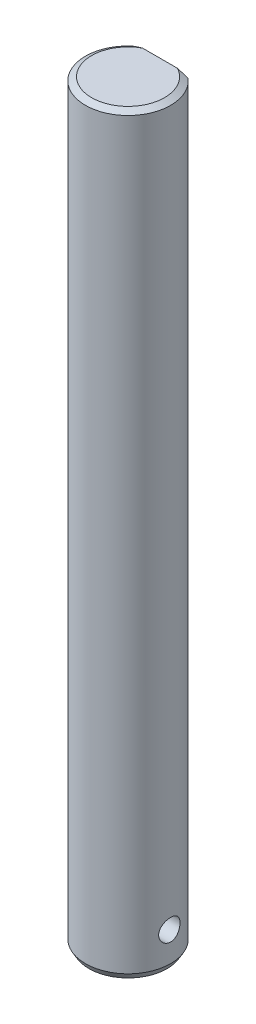
ISO-10303-21;
HEADER;
FILE_DESCRIPTION(('STEP AP214'),'2;1');
FILE_NAME('part.step','',(''),(''),'','','');
FILE_SCHEMA(('AUTOMOTIVE_DESIGN { 1 0 10303 214 1 1 1 1 }'));
ENDSEC;
DATA;
#1=APPLICATION_CONTEXT('core data for automotive mechanical design processes');
#2=APPLICATION_PROTOCOL_DEFINITION('international standard','automotive_design',2000,#1);
#3=PRODUCT_CONTEXT('',#1,'mechanical');
#4=PRODUCT('Part','Part','',(#3));
#5=PRODUCT_RELATED_PRODUCT_CATEGORY('part','',(#4));
#6=PRODUCT_DEFINITION_FORMATION('','',#4);
#7=PRODUCT_DEFINITION_CONTEXT('part definition',#1,'design');
#8=PRODUCT_DEFINITION('design','',#6,#7);
#9=PRODUCT_DEFINITION_SHAPE('','',#8);
#10=(LENGTH_UNIT() NAMED_UNIT(*) SI_UNIT(.MILLI.,.METRE.));
#11=(NAMED_UNIT(*) PLANE_ANGLE_UNIT() SI_UNIT($,.RADIAN.));
#12=(NAMED_UNIT(*) SI_UNIT($,.STERADIAN.) SOLID_ANGLE_UNIT());
#13=UNCERTAINTY_MEASURE_WITH_UNIT(LENGTH_MEASURE(1.E-05),#10,'distance_accuracy_value','');
#14=(GEOMETRIC_REPRESENTATION_CONTEXT(3) GLOBAL_UNCERTAINTY_ASSIGNED_CONTEXT((#13)) GLOBAL_UNIT_ASSIGNED_CONTEXT((#10,
#11,#12)) REPRESENTATION_CONTEXT('',''));
#15=CARTESIAN_POINT('',(0.,0.,0.));
#16=DIRECTION('',(0.,0.,1.));
#17=DIRECTION('',(1.,0.,0.));
#18=AXIS2_PLACEMENT_3D('',#15,#16,#17);
#19=CARTESIAN_POINT('',(0.,106.,0.));
#20=DIRECTION('',(0.,-1.,0.));
#21=DIRECTION('',(0.,0.,-1.));
#22=AXIS2_PLACEMENT_3D('',#19,#20,#21);
#23=CYLINDRICAL_SURFACE('',#22,6.);
#24=CARTESIAN_POINT('',(0.,0.866025403784401,0.));
#25=DIRECTION('',(0.,1.,0.));
#26=DIRECTION('',(0.,0.,1.));
#27=AXIS2_PLACEMENT_3D('',#24,#25,#26);
#28=CIRCLE('',#27,6.);
#29=CARTESIAN_POINT('',(0.,0.866025403784401,6.));
#30=VERTEX_POINT('',#29);
#31=EDGE_CURVE('E145',#30,#30,#28,.T.);
#32=ORIENTED_EDGE('',*,*,#31,.T.);
#33=EDGE_LOOP('',(#32));
#34=FACE_BOUND('',#33,.T.);
#35=CARTESIAN_POINT('',(-5.80947501931113,5.,-1.5));
#36=CARTESIAN_POINT('',(-5.80947660051185,5.08283045055477,-1.49999764715507));
#37=CARTESIAN_POINT('',(-5.81126583608348,5.1656869392068,-1.49311574729838));
#38=CARTESIAN_POINT('',(-5.81821117195949,5.32902054690442,-1.46581387527848));
#39=CARTESIAN_POINT('',(-5.82336923173088,5.409496252681,-1.44538602404532));
#40=CARTESIAN_POINT('',(-5.8364323475758,5.56568212291222,-1.39169471977917));
#41=CARTESIAN_POINT('',(-5.84433385614245,5.6413982932314,-1.35844783671268));
#42=CARTESIAN_POINT('',(-5.86198915217285,5.78618651152395,-1.28011268475685));
#43=CARTESIAN_POINT('',(-5.87174301827101,5.85525827724814,-1.23502391313642));
#44=CARTESIAN_POINT('',(-5.89224429813367,5.98631698715732,-1.13322505638713));
#45=CARTESIAN_POINT('',(-5.90300758573818,6.04813616021003,-1.07630213262243));
#46=CARTESIAN_POINT('',(-5.92417725309178,6.16145683661621,-0.952909238460399));
#47=CARTESIAN_POINT('',(-5.93458359939834,6.21295737537305,-0.886438376508184));
#48=CARTESIAN_POINT('',(-5.95404249312349,6.30486528057877,-0.744687120647372));
#49=CARTESIAN_POINT('',(-5.96307412440355,6.34510783289688,-0.669296745717072));
#50=CARTESIAN_POINT('',(-5.97858487155591,6.41228578649185,-0.512557910575657));
#51=CARTESIAN_POINT('',(-5.98506436400607,6.43922315114931,-0.431210331475164));
#52=CARTESIAN_POINT('',(-5.99462855308908,6.47848870074715,-0.266615255252496));
#53=CARTESIAN_POINT('',(-5.99777936306589,6.49110178659595,-0.183439631729385));
#54=CARTESIAN_POINT('',(-6.00056156464379,6.50225502756533,-0.0160972915576611));
#55=CARTESIAN_POINT('',(-6.00019347658022,6.50079726332576,0.0680692767228416));
#56=CARTESIAN_POINT('',(-5.99602856972121,6.48405508984991,0.233028370758581));
#57=CARTESIAN_POINT('',(-5.99230801404524,6.46907820496769,0.313854323401601));
#58=CARTESIAN_POINT('',(-5.98194501914912,6.4262172379709,0.47180737112053));
#59=CARTESIAN_POINT('',(-5.97530242439065,6.39833246877355,0.548934269055657));
#60=CARTESIAN_POINT('',(-5.95972505820537,6.33019845758776,0.69811005525271));
#61=CARTESIAN_POINT('',(-5.95077011817032,6.28983977320295,0.770106764649757));
#62=CARTESIAN_POINT('',(-5.9315394228579,6.19798659253025,0.906413433510733));
#63=CARTESIAN_POINT('',(-5.92126343791494,6.14649015886363,0.970722052628258));
#64=CARTESIAN_POINT('',(-5.90018228261712,6.03217475481057,1.09166105262743));
#65=CARTESIAN_POINT('',(-5.88937031715551,5.96908706459134,1.1480365186128));
#66=CARTESIAN_POINT('',(-5.86869026110024,5.83424001587585,1.24946456394453));
#67=CARTESIAN_POINT('',(-5.85882221463582,5.7624802523054,1.29451661406902));
#68=CARTESIAN_POINT('',(-5.84112298098989,5.61182597951062,1.3721821935339));
#69=CARTESIAN_POINT('',(-5.83330190235432,5.53289856181208,1.40473435045574));
#70=CARTESIAN_POINT('',(-5.82071184083974,5.37044871915413,1.45602843095451));
#71=CARTESIAN_POINT('',(-5.81594220486131,5.28692728161012,1.47477330982936));
#72=CARTESIAN_POINT('',(-5.81013213623485,5.12002429908613,1.49749778319911));
#73=CARTESIAN_POINT('',(-5.80899653456189,5.03669732400222,1.50185428435178));
#74=CARTESIAN_POINT('',(-5.81032406088624,4.8705068380531,1.49671019430933));
#75=CARTESIAN_POINT('',(-5.8127868576076,4.78764328522926,1.48721087870928));
#76=CARTESIAN_POINT('',(-5.82094249172736,4.62613144102718,1.4549552783626));
#77=CARTESIAN_POINT('',(-5.82658182140625,4.54743636405749,1.43241844096905));
#78=CARTESIAN_POINT('',(-5.84040430962577,4.39494112528899,1.37497084900237));
#79=CARTESIAN_POINT('',(-5.84858776949168,4.3211415445668,1.34005862862753));
#80=CARTESIAN_POINT('',(-5.86677682255958,4.17893523327959,1.25806240076193));
#81=CARTESIAN_POINT('',(-5.87681501163985,4.11066269597414,1.21075305230138));
#82=CARTESIAN_POINT('',(-5.8975024984303,3.98288698231919,1.10559043940168));
#83=CARTESIAN_POINT('',(-5.90815189637082,3.92338525000996,1.04773544220816));
#84=CARTESIAN_POINT('',(-5.92918441818964,3.81331337445743,0.921394081477089));
#85=CARTESIAN_POINT('',(-5.93955421237102,3.76300396247071,0.852677928797389));
#86=CARTESIAN_POINT('',(-5.95858329968241,3.67463847982925,0.707554024042013));
#87=CARTESIAN_POINT('',(-5.96724268202376,3.63658177003508,0.631146673436387));
#88=CARTESIAN_POINT('',(-5.98182069442989,3.57413237928324,0.473337302596636));
#89=CARTESIAN_POINT('',(-5.98775898013446,3.54964142937256,0.391976071541822));
#90=CARTESIAN_POINT('',(-5.99631176037473,3.51472379923495,0.226124640478212));
#91=CARTESIAN_POINT('',(-5.99892689636045,3.50429440475657,0.141635047561866));
#92=CARTESIAN_POINT('',(-6.00051254113217,3.4979486156367,-0.0256252896649892));
#93=CARTESIAN_POINT('',(-5.99957968320012,3.50164743635691,-0.108380740449049));
#94=CARTESIAN_POINT('',(-5.99438844686135,3.5225717409415,-0.272051244622109));
#95=CARTESIAN_POINT('',(-5.99013016735643,3.53979682251965,-0.35296635267133));
#96=CARTESIAN_POINT('',(-5.97878149280944,3.58707832965639,-0.510256553467224));
#97=CARTESIAN_POINT('',(-5.97170646753999,3.61706517997194,-0.586653741871528));
#98=CARTESIAN_POINT('',(-5.95546933370076,3.68895586852899,-0.733375579562202));
#99=CARTESIAN_POINT('',(-5.94630696206604,3.73086120900435,-0.803699461897577));
#100=CARTESIAN_POINT('',(-5.92660874521999,3.82657285099561,-0.938102892635849));
#101=CARTESIAN_POINT('',(-5.91604525418417,3.88064021436107,-1.00199248245088));
#102=CARTESIAN_POINT('',(-5.89485973579863,3.9986342779607,-1.11992253040688));
#103=CARTESIAN_POINT('',(-5.88423769428834,4.06256347414686,-1.17396048760228));
#104=CARTESIAN_POINT('',(-5.86391213790822,4.199902121302,-1.27164303971884));
#105=CARTESIAN_POINT('',(-5.85422945594827,4.27346618511894,-1.31507492916982));
#106=CARTESIAN_POINT('',(-5.83715933325924,4.42708323488405,-1.3888903449235));
#107=CARTESIAN_POINT('',(-5.82977022370054,4.50713144916011,-1.41928336463958));
#108=CARTESIAN_POINT('',(-5.81927863109675,4.65586551774007,-1.46163379284816));
#109=CARTESIAN_POINT('',(-5.8156299450082,4.72383974657579,-1.47598975589307));
#110=CARTESIAN_POINT('',(-5.81072757878358,4.86120330349995,-1.4951734388599));
#111=CARTESIAN_POINT('',(-5.80947369434945,4.93059251036759,-1.50000197155828));
#112=CARTESIAN_POINT('',(-5.80947501931113,5.,-1.5));
#113=B_SPLINE_CURVE_WITH_KNOTS('',3,(#35,#36,#37,#38,#39,#40,#41,#42,#43,#44,#45,#46,#47,#48,
#49,#50,#51,#52,#53,#54,#55,#56,#57,#58,#59,#60,#61,#62,#63,#64,#65,#66,#67,#68,#69,#70,#71,#72,
#73,#74,#75,#76,#77,#78,#79,#80,#81,#82,#83,#84,#85,#86,#87,#88,#89,#90,#91,#92,#93,#94,#95,#96,
#97,#98,#99,#100,#101,#102,#103,#104,#105,#106,#107,#108,#109,#110,#111,#112),.UNSPECIFIED.,.T.,
.F.,(4,2,2,2,2,2,2,2,2,2,2,2,2,2,2,2,2,2,2,2,2,2,2,2,2,2,2,2,2,2,2,2,2,2,2,2,2,2,4),(0.,
0.248236465041681,0.4966174448572,0.744678436299612,0.99274996053287,1.24574372515786,
1.4987611288792,1.75530897838752,2.01181895908255,2.26313250597208,2.51440889199612,
2.76010957613368,3.00582334034872,3.25375724552667,3.50173431281348,3.75642279943147,
4.01112318719881,4.26705859205041,4.52293920077728,4.7720614485703,5.02116076310281,
5.26618443005524,5.5112371285285,5.76109707515494,6.01099811331027,6.26715198579191,
6.52329249431732,6.77755243684158,7.03176329345423,7.27910067676474,7.52643070426189,
7.77242925935827,8.01845883442843,8.27038257949243,8.52237018939306,8.77905886370806,
9.03556032819972,9.24358696306398,9.45159585059713),.UNSPECIFIED.);
#114=CARTESIAN_POINT('',(-5.80947501931113,5.,-1.5));
#115=VERTEX_POINT('',#114);
#116=EDGE_CURVE('E93',#115,#115,#113,.T.);
#117=ORIENTED_EDGE('',*,*,#116,.T.);
#118=EDGE_LOOP('',(#117));
#119=FACE_BOUND('',#118,.T.);
#120=CARTESIAN_POINT('',(5.80947501931113,5.,-1.5));
#121=CARTESIAN_POINT('',(5.80947660051185,4.91716954944523,-1.49999764715507));
#122=CARTESIAN_POINT('',(5.81126583608348,4.8343130607932,-1.49311574729838));
#123=CARTESIAN_POINT('',(5.81821117195949,4.67097945309558,-1.46581387527848));
#124=CARTESIAN_POINT('',(5.82336923173088,4.590503747319,-1.44538602404532));
#125=CARTESIAN_POINT('',(5.8364323475758,4.43431787708778,-1.39169471977917));
#126=CARTESIAN_POINT('',(5.84433385614245,4.3586017067686,-1.35844783671268));
#127=CARTESIAN_POINT('',(5.86198915217285,4.21381348847605,-1.28011268475685));
#128=CARTESIAN_POINT('',(5.87174301827101,4.14474172275186,-1.23502391313642));
#129=CARTESIAN_POINT('',(5.89224429813367,4.01368301284268,-1.13322505638713));
#130=CARTESIAN_POINT('',(5.90300758573818,3.95186383978997,-1.07630213262243));
#131=CARTESIAN_POINT('',(5.92417725309178,3.83854316338379,-0.952909238460399));
#132=CARTESIAN_POINT('',(5.93458359939834,3.78704262462695,-0.886438376508185));
#133=CARTESIAN_POINT('',(5.95404249312349,3.69513471942123,-0.744687120647373));
#134=CARTESIAN_POINT('',(5.96307412440355,3.65489216710312,-0.669296745717072));
#135=CARTESIAN_POINT('',(5.97858487155591,3.58771421350815,-0.512557910575657));
#136=CARTESIAN_POINT('',(5.98506436400607,3.56077684885069,-0.431210331475164));
#137=CARTESIAN_POINT('',(5.99462855308908,3.52151129925285,-0.266615255252496));
#138=CARTESIAN_POINT('',(5.99777936306589,3.50889821340405,-0.183439631729385));
#139=CARTESIAN_POINT('',(6.00056156464379,3.49774497243467,-0.0160972915576611));
#140=CARTESIAN_POINT('',(6.00019347658022,3.49920273667424,0.0680692767228415));
#141=CARTESIAN_POINT('',(5.99602856972121,3.51594491015009,0.233028370758581));
#142=CARTESIAN_POINT('',(5.99230801404524,3.53092179503231,0.313854323401601));
#143=CARTESIAN_POINT('',(5.98194501914912,3.5737827620291,0.47180737112053));
#144=CARTESIAN_POINT('',(5.97530242439065,3.60166753122645,0.548934269055657));
#145=CARTESIAN_POINT('',(5.95972505820537,3.66980154241224,0.69811005525271));
#146=CARTESIAN_POINT('',(5.95077011817032,3.71016022679705,0.770106764649757));
#147=CARTESIAN_POINT('',(5.9315394228579,3.80201340746975,0.906413433510733));
#148=CARTESIAN_POINT('',(5.92126343791494,3.85350984113637,0.970722052628258));
#149=CARTESIAN_POINT('',(5.90018228261712,3.96782524518943,1.09166105262743));
#150=CARTESIAN_POINT('',(5.88937031715551,4.03091293540866,1.1480365186128));
#151=CARTESIAN_POINT('',(5.86869026110024,4.16575998412415,1.24946456394453));
#152=CARTESIAN_POINT('',(5.85882221463582,4.2375197476946,1.29451661406902));
#153=CARTESIAN_POINT('',(5.84112298098989,4.38817402048938,1.3721821935339));
#154=CARTESIAN_POINT('',(5.83330190235432,4.46710143818792,1.40473435045574));
#155=CARTESIAN_POINT('',(5.82071184083974,4.62955128084587,1.45602843095451));
#156=CARTESIAN_POINT('',(5.81594220486131,4.71307271838988,1.47477330982936));
#157=CARTESIAN_POINT('',(5.81013213623485,4.87997570091387,1.49749778319911));
#158=CARTESIAN_POINT('',(5.80899653456189,4.96330267599778,1.50185428435178));
#159=CARTESIAN_POINT('',(5.81032406088624,5.1294931619469,1.49671019430933));
#160=CARTESIAN_POINT('',(5.8127868576076,5.21235671477074,1.48721087870928));
#161=CARTESIAN_POINT('',(5.82094249172736,5.37386855897282,1.4549552783626));
#162=CARTESIAN_POINT('',(5.82658182140625,5.45256363594251,1.43241844096905));
#163=CARTESIAN_POINT('',(5.84040430962577,5.60505887471101,1.37497084900237));
#164=CARTESIAN_POINT('',(5.84858776949168,5.6788584554332,1.34005862862753));
#165=CARTESIAN_POINT('',(5.86677682255958,5.82106476672041,1.25806240076193));
#166=CARTESIAN_POINT('',(5.87681501163985,5.88933730402586,1.21075305230138));
#167=CARTESIAN_POINT('',(5.8975024984303,6.01711301768081,1.10559043940168));
#168=CARTESIAN_POINT('',(5.90815189637082,6.07661474999004,1.04773544220816));
#169=CARTESIAN_POINT('',(5.92918441818964,6.18668662554257,0.921394081477089));
#170=CARTESIAN_POINT('',(5.93955421237101,6.23699603752929,0.852677928797389));
#171=CARTESIAN_POINT('',(5.95858329968241,6.32536152017075,0.707554024042013));
#172=CARTESIAN_POINT('',(5.96724268202376,6.36341822996492,0.631146673436387));
#173=CARTESIAN_POINT('',(5.98182069442989,6.42586762071676,0.473337302596636));
#174=CARTESIAN_POINT('',(5.98775898013446,6.45035857062744,0.391976071541822));
#175=CARTESIAN_POINT('',(5.99631176037473,6.48527620076505,0.226124640478212));
#176=CARTESIAN_POINT('',(5.99892689636045,6.49570559524343,0.141635047561865));
#177=CARTESIAN_POINT('',(6.00051254113217,6.5020513843633,-0.0256252896649894));
#178=CARTESIAN_POINT('',(5.99957968320012,6.49835256364309,-0.10838074044905));
#179=CARTESIAN_POINT('',(5.99438844686135,6.4774282590585,-0.272051244622109));
#180=CARTESIAN_POINT('',(5.99013016735643,6.46020317748035,-0.35296635267133));
#181=CARTESIAN_POINT('',(5.97878149280944,6.41292167034361,-0.510256553467224));
#182=CARTESIAN_POINT('',(5.97170646753999,6.38293482002806,-0.586653741871528));
#183=CARTESIAN_POINT('',(5.95546933370076,6.31104413147101,-0.733375579562202));
#184=CARTESIAN_POINT('',(5.94630696206604,6.26913879099565,-0.803699461897577));
#185=CARTESIAN_POINT('',(5.92660874521999,6.17342714900439,-0.938102892635849));
#186=CARTESIAN_POINT('',(5.91604525418417,6.11935978563893,-1.00199248245088));
#187=CARTESIAN_POINT('',(5.89485973579863,6.0013657220393,-1.11992253040688));
#188=CARTESIAN_POINT('',(5.88423769428834,5.93743652585314,-1.17396048760228));
#189=CARTESIAN_POINT('',(5.86391213790822,5.800097878698,-1.27164303971884));
#190=CARTESIAN_POINT('',(5.85422945594827,5.72653381488106,-1.31507492916982));
#191=CARTESIAN_POINT('',(5.83715933325924,5.57291676511595,-1.3888903449235));
#192=CARTESIAN_POINT('',(5.82977022370054,5.49286855083989,-1.41928336463958));
#193=CARTESIAN_POINT('',(5.81927863109675,5.34413448225992,-1.46163379284816));
#194=CARTESIAN_POINT('',(5.8156299450082,5.27616025342421,-1.47598975589307));
#195=CARTESIAN_POINT('',(5.81072757878358,5.13879669650005,-1.4951734388599));
#196=CARTESIAN_POINT('',(5.80947369434945,5.06940748963241,-1.50000197155828));
#197=CARTESIAN_POINT('',(5.80947501931113,5.,-1.5));
#198=B_SPLINE_CURVE_WITH_KNOTS('',3,(#120,#121,#122,#123,#124,#125,#126,#127,#128,#129,#130,
#131,#132,#133,#134,#135,#136,#137,#138,#139,#140,#141,#142,#143,#144,#145,#146,#147,#148,#149,
#150,#151,#152,#153,#154,#155,#156,#157,#158,#159,#160,#161,#162,#163,#164,#165,#166,#167,#168,
#169,#170,#171,#172,#173,#174,#175,#176,#177,#178,#179,#180,#181,#182,#183,#184,#185,#186,#187,
#188,#189,#190,#191,#192,#193,#194,#195,#196,#197),.UNSPECIFIED.,.T.,.F.,(4,2,2,2,2,2,2,2,2,2,2,
2,2,2,2,2,2,2,2,2,2,2,2,2,2,2,2,2,2,2,2,2,2,2,2,2,2,2,4),(0.,0.248236465041681,0.4966174448572,
0.744678436299612,0.99274996053287,1.24574372515786,1.4987611288792,1.75530897838752,
2.01181895908255,2.26313250597208,2.51440889199612,2.76010957613368,3.00582334034872,
3.25375724552667,3.50173431281348,3.75642279943147,4.01112318719881,4.26705859205042,
4.52293920077729,4.7720614485703,5.02116076310281,5.26618443005524,5.5112371285285,
5.76109707515494,6.01099811331027,6.26715198579191,6.52329249431732,6.77755243684157,
7.03176329345423,7.27910067676474,7.52643070426189,7.77242925935826,8.01845883442843,
8.27038257949242,8.52237018939305,8.77905886370806,9.03556032819971,9.24358696306398,
9.45159585059712),.UNSPECIFIED.);
#199=CARTESIAN_POINT('',(5.80947501931113,5.,-1.5));
#200=VERTEX_POINT('',#199);
#201=EDGE_CURVE('E99',#200,#200,#198,.T.);
#202=ORIENTED_EDGE('',*,*,#201,.T.);
#203=EDGE_LOOP('',(#202));
#204=FACE_BOUND('',#203,.T.);
#205=DIRECTION('',(0.,-1.,0.));
#206=VECTOR('',#205,1.);
#207=CARTESIAN_POINT('',(3.96862696659689,106.,-4.5));
#208=LINE('',#207,#206);
#209=CARTESIAN_POINT('',(3.96862696659689,96.,-4.5));
#210=VERTEX_POINT('',#209);
#211=CARTESIAN_POINT('',(3.96862696659689,105.5,-4.5));
#212=VERTEX_POINT('',#211);
#213=EDGE_CURVE('E82',#210,#212,#208,.F.);
#214=ORIENTED_EDGE('',*,*,#213,.T.);
#215=CARTESIAN_POINT('',(0.,105.5,0.));
#216=DIRECTION('',(0.,1.,0.));
#217=DIRECTION('',(0.,0.,1.));
#218=AXIS2_PLACEMENT_3D('',#215,#216,#217);
#219=CIRCLE('',#218,6.);
#220=CARTESIAN_POINT('',(-3.96862696659689,105.5,-4.5));
#221=VERTEX_POINT('',#220);
#222=EDGE_CURVE('E51',#212,#221,#219,.F.);
#223=ORIENTED_EDGE('',*,*,#222,.T.);
#224=DIRECTION('',(0.,-1.,0.));
#225=VECTOR('',#224,1.);
#226=CARTESIAN_POINT('',(-3.96862696659689,106.,-4.5));
#227=LINE('',#226,#225);
#228=CARTESIAN_POINT('',(-3.96862696659689,96.,-4.5));
#229=VERTEX_POINT('',#228);
#230=EDGE_CURVE('E75',#221,#229,#227,.T.);
#231=ORIENTED_EDGE('',*,*,#230,.T.);
#232=CARTESIAN_POINT('',(0.,96.,0.));
#233=DIRECTION('',(0.,1.,0.));
#234=DIRECTION('',(0.,0.,1.));
#235=AXIS2_PLACEMENT_3D('',#232,#233,#234);
#236=CIRCLE('',#235,6.);
#237=EDGE_CURVE('E77',#210,#229,#236,.T.);
#238=ORIENTED_EDGE('',*,*,#237,.F.);
#239=EDGE_LOOP('',(#214,#223,#231,#238));
#240=FACE_BOUND('',#239,.T.);
#241=ADVANCED_FACE('F41',(#34,#119,#204,#240),#23,.T.);
#242=CARTESIAN_POINT('',(0.,106.,0.));
#243=DIRECTION('',(0.,1.,0.));
#244=DIRECTION('',(0.,0.,1.));
#245=AXIS2_PLACEMENT_3D('',#242,#243,#244);
#246=PLANE('',#245);
#247=DIRECTION('',(1.,0.,0.));
#248=VECTOR('',#247,1.);
#249=CARTESIAN_POINT('',(0.,106.,-4.5));
#250=LINE('',#249,#248);
#251=CARTESIAN_POINT('',(-2.47137515456208,106.,-4.5));
#252=VERTEX_POINT('',#251);
#253=CARTESIAN_POINT('',(2.47137515456208,106.,-4.5));
#254=VERTEX_POINT('',#253);
#255=EDGE_CURVE('E81',#252,#254,#250,.T.);
#256=ORIENTED_EDGE('',*,*,#255,.F.);
#257=CARTESIAN_POINT('',(0.,106.,0.));
#258=DIRECTION('',(0.,1.,0.));
#259=DIRECTION('',(0.,0.,1.));
#260=AXIS2_PLACEMENT_3D('',#257,#258,#259);
#261=CIRCLE('',#260,5.13397459621556);
#262=EDGE_CURVE('E89',#252,#254,#261,.T.);
#263=ORIENTED_EDGE('',*,*,#262,.T.);
#264=EDGE_LOOP('',(#256,#263));
#265=FACE_BOUND('',#264,.T.);
#266=ADVANCED_FACE('F130',(#265),#246,.T.);
#267=CARTESIAN_POINT('',(0.,0.,0.));
#268=DIRECTION('',(0.,1.,0.));
#269=DIRECTION('',(0.,0.,1.));
#270=AXIS2_PLACEMENT_3D('',#267,#268,#269);
#271=PLANE('',#270);
#272=CARTESIAN_POINT('',(0.,0.,0.));
#273=DIRECTION('',(0.,1.,0.));
#274=DIRECTION('',(0.,0.,1.));
#275=AXIS2_PLACEMENT_3D('',#272,#273,#274);
#276=CIRCLE('',#275,5.50000000000003);
#277=CARTESIAN_POINT('',(0.,0.,5.50000000000003));
#278=VERTEX_POINT('',#277);
#279=EDGE_CURVE('E11',#278,#278,#276,.F.);
#280=ORIENTED_EDGE('',*,*,#279,.T.);
#281=EDGE_LOOP('',(#280));
#282=FACE_BOUND('',#281,.T.);
#283=ADVANCED_FACE('F126',(#282),#271,.F.);
#284=CARTESIAN_POINT('',(0.,96.,0.));
#285=DIRECTION('',(0.,1.,0.));
#286=DIRECTION('',(0.,0.,1.));
#287=AXIS2_PLACEMENT_3D('',#284,#285,#286);
#288=PLANE('',#287);
#289=ORIENTED_EDGE('',*,*,#237,.T.);
#290=DIRECTION('',(1.,0.,0.));
#291=VECTOR('',#290,1.);
#292=CARTESIAN_POINT('',(-6.42023511562401,96.,-4.5));
#293=LINE('',#292,#291);
#294=EDGE_CURVE('E87',#229,#210,#293,.T.);
#295=ORIENTED_EDGE('',*,*,#294,.T.);
#296=EDGE_LOOP('',(#289,#295));
#297=FACE_BOUND('',#296,.T.);
#298=ADVANCED_FACE('F86',(#297),#288,.T.);
#299=CARTESIAN_POINT('',(-6.42023511562401,96.,-4.5));
#300=DIRECTION('',(0.,0.,1.));
#301=DIRECTION('',(1.,0.,0.));
#302=AXIS2_PLACEMENT_3D('',#299,#300,#301);
#303=PLANE('',#302);
#304=ORIENTED_EDGE('',*,*,#255,.T.);
#305=CARTESIAN_POINT('',(2.47137515456208,106.,-4.5));
#306=CARTESIAN_POINT('',(2.59821029234091,105.964741067028,-4.5));
#307=CARTESIAN_POINT('',(2.72449842776643,105.927566203446,-4.5));
#308=CARTESIAN_POINT('',(2.97597185015973,105.849882020878,-4.5));
#309=CARTESIAN_POINT('',(3.10115769990573,105.809374527543,-4.5));
#310=CARTESIAN_POINT('',(3.35054029678143,105.725488234176,-4.5));
#311=CARTESIAN_POINT('',(3.47473716361617,105.682109787745,-4.5));
#312=CARTESIAN_POINT('',(3.72230196848673,105.592839293428,-4.5));
#313=CARTESIAN_POINT('',(3.84566941885811,105.54694589105,-4.5));
#314=CARTESIAN_POINT('',(3.96862696659689,105.5,-4.5));
#315=B_SPLINE_CURVE_WITH_KNOTS('',3,(#305,#306,#307,#308,#309,#310,#311,#312,#313,#314),
.UNSPECIFIED.,.F.,.F.,(4,2,2,2,4),(0.,0.394899349737702,0.789583791657925,1.18421971236831,
1.57907030390004),.UNSPECIFIED.);
#316=EDGE_CURVE('E65',#254,#212,#315,.T.);
#317=ORIENTED_EDGE('',*,*,#316,.T.);
#318=ORIENTED_EDGE('',*,*,#213,.F.);
#319=ORIENTED_EDGE('',*,*,#294,.F.);
#320=ORIENTED_EDGE('',*,*,#230,.F.);
#321=CARTESIAN_POINT('',(-3.96862696659689,105.5,-4.5));
#322=CARTESIAN_POINT('',(-3.84566941885811,105.54694589105,-4.5));
#323=CARTESIAN_POINT('',(-3.72230196848673,105.592839293428,-4.5));
#324=CARTESIAN_POINT('',(-3.47473716361617,105.682109787745,-4.5));
#325=CARTESIAN_POINT('',(-3.35054029678143,105.725488234176,-4.5));
#326=CARTESIAN_POINT('',(-3.10115769990573,105.809374527543,-4.5));
#327=CARTESIAN_POINT('',(-2.97597185015973,105.849882020878,-4.5));
#328=CARTESIAN_POINT('',(-2.72449842776643,105.927566203446,-4.5));
#329=CARTESIAN_POINT('',(-2.59821029234091,105.964741067028,-4.5));
#330=CARTESIAN_POINT('',(-2.47137515456208,106.,-4.5));
#331=B_SPLINE_CURVE_WITH_KNOTS('',3,(#321,#322,#323,#324,#325,#326,#327,#328,#329,#330),
.UNSPECIFIED.,.F.,.F.,(4,2,2,2,4),(0.,0.394850591531729,0.789486512242111,1.18417095416234,
1.57907030390004),.UNSPECIFIED.);
#332=EDGE_CURVE('E133',#221,#252,#331,.T.);
#333=ORIENTED_EDGE('',*,*,#332,.T.);
#334=EDGE_LOOP('',(#304,#317,#318,#319,#320,#333));
#335=FACE_BOUND('',#334,.T.);
#336=ADVANCED_FACE('F91',(#335),#303,.F.);
#337=CARTESIAN_POINT('',(-10.,5.,0.));
#338=DIRECTION('',(1.,0.,0.));
#339=DIRECTION('',(0.,0.,-1.));
#340=AXIS2_PLACEMENT_3D('',#337,#338,#339);
#341=CYLINDRICAL_SURFACE('',#340,1.5);
#342=ORIENTED_EDGE('',*,*,#201,.F.);
#343=EDGE_LOOP('',(#342));
#344=FACE_BOUND('',#343,.T.);
#345=ORIENTED_EDGE('',*,*,#116,.F.);
#346=EDGE_LOOP('',(#345));
#347=FACE_BOUND('',#346,.T.);
#348=ADVANCED_FACE('F117',(#344,#347),#341,.F.);
#349=CARTESIAN_POINT('',(0.,106.,0.));
#350=DIRECTION('',(0.,-1.,0.));
#351=DIRECTION('',(0.,0.,-1.));
#352=AXIS2_PLACEMENT_3D('',#349,#350,#351);
#353=CONICAL_SURFACE('',#352,5.13397459621556,1.04719755119659);
#354=ORIENTED_EDGE('',*,*,#332,.F.);
#355=ORIENTED_EDGE('',*,*,#222,.F.);
#356=ORIENTED_EDGE('',*,*,#316,.F.);
#357=ORIENTED_EDGE('',*,*,#262,.F.);
#358=EDGE_LOOP('',(#354,#355,#356,#357));
#359=FACE_BOUND('',#358,.T.);
#360=ADVANCED_FACE('F121',(#359),#353,.T.);
#361=CARTESIAN_POINT('',(0.,0.866025403784401,0.));
#362=DIRECTION('',(0.,1.,0.));
#363=DIRECTION('',(0.,0.,1.));
#364=AXIS2_PLACEMENT_3D('',#361,#362,#363);
#365=CONICAL_SURFACE('',#364,6.,0.523598775598296);
#366=ORIENTED_EDGE('',*,*,#279,.F.);
#367=EDGE_LOOP('',(#366));
#368=FACE_BOUND('',#367,.T.);
#369=ORIENTED_EDGE('',*,*,#31,.F.);
#370=EDGE_LOOP('',(#369));
#371=FACE_BOUND('',#370,.T.);
#372=ADVANCED_FACE('F44',(#368,#371),#365,.T.);
#373=CLOSED_SHELL('',(#241,#266,#283,#298,#336,#348,#360,#372));
#374=MANIFOLD_SOLID_BREP('B2',#373);
#375=ADVANCED_BREP_SHAPE_REPRESENTATION('',(#18,#374),#14);
#376=SHAPE_DEFINITION_REPRESENTATION(#9,#375);
ENDSEC;
END-ISO-10303-21;
